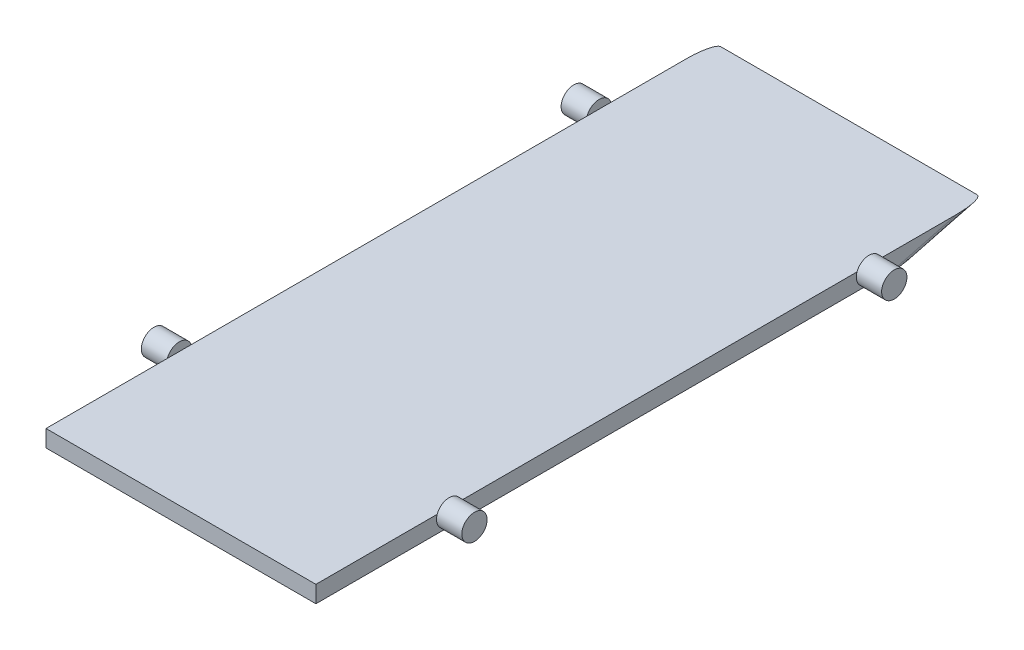
ISO-10303-21;
HEADER;
FILE_DESCRIPTION(('STEP AP214'),'2;1');
FILE_NAME('part.step','',(''),(''),'','','');
FILE_SCHEMA(('AUTOMOTIVE_DESIGN { 1 0 10303 214 1 1 1 1 }'));
ENDSEC;
DATA;
#1=APPLICATION_CONTEXT('core data for automotive mechanical design processes');
#2=APPLICATION_PROTOCOL_DEFINITION('international standard','automotive_design',2000,#1);
#3=PRODUCT_CONTEXT('',#1,'mechanical');
#4=PRODUCT('Part','Part','',(#3));
#5=PRODUCT_RELATED_PRODUCT_CATEGORY('part','',(#4));
#6=PRODUCT_DEFINITION_FORMATION('','',#4);
#7=PRODUCT_DEFINITION_CONTEXT('part definition',#1,'design');
#8=PRODUCT_DEFINITION('design','',#6,#7);
#9=PRODUCT_DEFINITION_SHAPE('','',#8);
#10=(LENGTH_UNIT() NAMED_UNIT(*) SI_UNIT(.MILLI.,.METRE.));
#11=(NAMED_UNIT(*) PLANE_ANGLE_UNIT() SI_UNIT($,.RADIAN.));
#12=(NAMED_UNIT(*) SI_UNIT($,.STERADIAN.) SOLID_ANGLE_UNIT());
#13=UNCERTAINTY_MEASURE_WITH_UNIT(LENGTH_MEASURE(1.E-05),#10,'distance_accuracy_value','');
#14=(GEOMETRIC_REPRESENTATION_CONTEXT(3) GLOBAL_UNCERTAINTY_ASSIGNED_CONTEXT((#13)) GLOBAL_UNIT_ASSIGNED_CONTEXT((#10,
#11,#12)) REPRESENTATION_CONTEXT('',''));
#15=CARTESIAN_POINT('',(0.,0.,0.));
#16=DIRECTION('',(0.,0.,1.));
#17=DIRECTION('',(1.,0.,0.));
#18=AXIS2_PLACEMENT_3D('',#15,#16,#17);
#19=CARTESIAN_POINT('',(40.,5.,-99.));
#20=DIRECTION('',(-1.,0.,0.));
#21=DIRECTION('',(0.,0.,1.));
#22=AXIS2_PLACEMENT_3D('',#19,#20,#21);
#23=PLANE('',#22);
#24=DIRECTION('',(0.,0.,-1.));
#25=VECTOR('',#24,1.);
#26=CARTESIAN_POINT('',(40.,5.,-99.));
#27=LINE('',#26,#25);
#28=CARTESIAN_POINT('',(40.,5.,55.9644660940673));
#29=VERTEX_POINT('',#28);
#30=CARTESIAN_POINT('',(40.,5.,-61.3933719084473));
#31=VERTEX_POINT('',#30);
#32=EDGE_CURVE('E203',#29,#31,#27,.T.);
#33=ORIENTED_EDGE('',*,*,#32,.F.);
#34=CARTESIAN_POINT('',(40.,3.75,59.5));
#35=DIRECTION('',(-1.,0.,0.));
#36=DIRECTION('',(0.,0.,1.));
#37=AXIS2_PLACEMENT_3D('',#34,#35,#36);
#38=CIRCLE('',#37,3.74999999999999);
#39=CARTESIAN_POINT('',(40.,0.,59.5));
#40=VERTEX_POINT('',#39);
#41=EDGE_CURVE('E183',#29,#40,#38,.T.);
#42=ORIENTED_EDGE('',*,*,#41,.T.);
#43=DIRECTION('',(0.,0.,-1.));
#44=VECTOR('',#43,1.);
#45=CARTESIAN_POINT('',(40.,0.,-99.));
#46=LINE('',#45,#44);
#47=CARTESIAN_POINT('',(40.,0.,-64.92890581438));
#48=VERTEX_POINT('',#47);
#49=EDGE_CURVE('E274',#40,#48,#46,.T.);
#50=ORIENTED_EDGE('',*,*,#49,.T.);
#51=CARTESIAN_POINT('',(40.,3.75,-64.92890581438));
#52=DIRECTION('',(-1.,0.,0.));
#53=DIRECTION('',(0.,0.,1.));
#54=AXIS2_PLACEMENT_3D('',#51,#52,#53);
#55=CIRCLE('',#54,3.75000000000001);
#56=EDGE_CURVE('E312',#48,#31,#55,.T.);
#57=ORIENTED_EDGE('',*,*,#56,.T.);
#58=EDGE_LOOP('',(#33,#42,#50,#57));
#59=FACE_BOUND('',#58,.T.);
#60=ADVANCED_FACE('F77',(#59),#23,.F.);
#61=CARTESIAN_POINT('',(40.,0.,-71.7485632957322));
#62=VERTEX_POINT('',#61);
#63=EDGE_CURVE('E267',#48,#62,#46,.T.);
#64=ORIENTED_EDGE('',*,*,#63,.T.);
#65=DIRECTION('',(0.,0.250993863675924,-0.967988677824814));
#66=VECTOR('',#65,1.);
#67=CARTESIAN_POINT('',(40.,6.93597735564963,-98.4980122726482));
#68=LINE('',#67,#66);
#69=CARTESIAN_POINT('',(40.,5.,-91.0316777043508));
#70=VERTEX_POINT('',#69);
#71=EDGE_CURVE('E241',#62,#70,#68,.T.);
#72=ORIENTED_EDGE('',*,*,#71,.T.);
#73=CARTESIAN_POINT('',(40.,5.,-68.4644397203128));
#74=VERTEX_POINT('',#73);
#75=EDGE_CURVE('E211',#74,#70,#27,.T.);
#76=ORIENTED_EDGE('',*,*,#75,.F.);
#77=EDGE_CURVE('E242',#74,#48,#55,.T.);
#78=ORIENTED_EDGE('',*,*,#77,.T.);
#79=EDGE_LOOP('',(#64,#72,#76,#78));
#80=FACE_BOUND('',#79,.T.);
#81=ADVANCED_FACE('F272',(#80),#23,.F.);
#82=CARTESIAN_POINT('',(-40.,5.,-99.));
#83=DIRECTION('',(1.,0.,0.));
#84=DIRECTION('',(0.,0.,-1.));
#85=AXIS2_PLACEMENT_3D('',#82,#83,#84);
#86=PLANE('',#85);
#87=CARTESIAN_POINT('',(-40.,3.75,-64.92890581438));
#88=DIRECTION('',(-1.,0.,0.));
#89=DIRECTION('',(0.,0.,1.));
#90=AXIS2_PLACEMENT_3D('',#87,#88,#89);
#91=CIRCLE('',#90,3.75000000000001);
#92=CARTESIAN_POINT('',(-40.,0.,-64.92890581438));
#93=VERTEX_POINT('',#92);
#94=CARTESIAN_POINT('',(-40.,5.,-61.3933719084473));
#95=VERTEX_POINT('',#94);
#96=EDGE_CURVE('E336',#93,#95,#91,.T.);
#97=ORIENTED_EDGE('',*,*,#96,.F.);
#98=DIRECTION('',(0.,0.,1.));
#99=VECTOR('',#98,1.);
#100=CARTESIAN_POINT('',(-40.,0.,-99.));
#101=LINE('',#100,#99);
#102=CARTESIAN_POINT('',(-40.,0.,59.5));
#103=VERTEX_POINT('',#102);
#104=EDGE_CURVE('E226',#93,#103,#101,.T.);
#105=ORIENTED_EDGE('',*,*,#104,.T.);
#106=CARTESIAN_POINT('',(-40.,3.75,59.5));
#107=DIRECTION('',(-1.,0.,0.));
#108=DIRECTION('',(0.,0.,1.));
#109=AXIS2_PLACEMENT_3D('',#106,#107,#108);
#110=CIRCLE('',#109,3.74999999999999);
#111=CARTESIAN_POINT('',(-40.,5.,55.9644660940673));
#112=VERTEX_POINT('',#111);
#113=EDGE_CURVE('E319',#112,#103,#110,.T.);
#114=ORIENTED_EDGE('',*,*,#113,.F.);
#115=DIRECTION('',(0.,0.,1.));
#116=VECTOR('',#115,1.);
#117=CARTESIAN_POINT('',(-40.,5.,-99.));
#118=LINE('',#117,#116);
#119=EDGE_CURVE('E289',#95,#112,#118,.T.);
#120=ORIENTED_EDGE('',*,*,#119,.F.);
#121=EDGE_LOOP('',(#97,#105,#114,#120));
#122=FACE_BOUND('',#121,.T.);
#123=ADVANCED_FACE('F362',(#122),#86,.F.);
#124=CARTESIAN_POINT('',(-40.,5.,-91.0316777043508));
#125=VERTEX_POINT('',#124);
#126=CARTESIAN_POINT('',(-40.,5.,-68.4644397203128));
#127=VERTEX_POINT('',#126);
#128=EDGE_CURVE('E282',#125,#127,#118,.T.);
#129=ORIENTED_EDGE('',*,*,#128,.F.);
#130=DIRECTION('',(0.,0.250993863675924,-0.967988677824814));
#131=VECTOR('',#130,1.);
#132=CARTESIAN_POINT('',(-40.,6.93597735564963,-98.4980122726482));
#133=LINE('',#132,#131);
#134=CARTESIAN_POINT('',(-40.,0.,-71.7485632957322));
#135=VERTEX_POINT('',#134);
#136=EDGE_CURVE('E12',#125,#135,#133,.F.);
#137=ORIENTED_EDGE('',*,*,#136,.T.);
#138=EDGE_CURVE('E220',#135,#93,#101,.T.);
#139=ORIENTED_EDGE('',*,*,#138,.T.);
#140=EDGE_CURVE('E287',#127,#93,#91,.T.);
#141=ORIENTED_EDGE('',*,*,#140,.F.);
#142=EDGE_LOOP('',(#129,#137,#139,#141));
#143=FACE_BOUND('',#142,.T.);
#144=ADVANCED_FACE('F285',(#143),#86,.F.);
#145=CARTESIAN_POINT('',(40.,0.,99.));
#146=VERTEX_POINT('',#145);
#147=EDGE_CURVE('E194',#146,#40,#46,.T.);
#148=ORIENTED_EDGE('',*,*,#147,.T.);
#149=CARTESIAN_POINT('',(40.,5.,63.0355339059327));
#150=VERTEX_POINT('',#149);
#151=EDGE_CURVE('E181',#40,#150,#38,.T.);
#152=ORIENTED_EDGE('',*,*,#151,.T.);
#153=CARTESIAN_POINT('',(40.,5.,99.));
#154=VERTEX_POINT('',#153);
#155=EDGE_CURVE('E192',#154,#150,#27,.T.);
#156=ORIENTED_EDGE('',*,*,#155,.F.);
#157=DIRECTION('',(0.,-1.,0.));
#158=VECTOR('',#157,1.);
#159=CARTESIAN_POINT('',(40.,5.,99.));
#160=LINE('',#159,#158);
#161=EDGE_CURVE('E231',#154,#146,#160,.T.);
#162=ORIENTED_EDGE('',*,*,#161,.T.);
#163=EDGE_LOOP('',(#148,#152,#156,#162));
#164=FACE_BOUND('',#163,.T.);
#165=ADVANCED_FACE('F190',(#164),#23,.F.);
#166=CARTESIAN_POINT('',(-40.,5.,63.0355339059327));
#167=VERTEX_POINT('',#166);
#168=EDGE_CURVE('E237',#103,#167,#110,.T.);
#169=ORIENTED_EDGE('',*,*,#168,.F.);
#170=CARTESIAN_POINT('',(-40.,0.,99.));
#171=VERTEX_POINT('',#170);
#172=EDGE_CURVE('E228',#103,#171,#101,.T.);
#173=ORIENTED_EDGE('',*,*,#172,.T.);
#174=DIRECTION('',(0.,-1.,0.));
#175=VECTOR('',#174,1.);
#176=CARTESIAN_POINT('',(-40.,5.,99.));
#177=LINE('',#176,#175);
#178=CARTESIAN_POINT('',(-40.,5.,99.));
#179=VERTEX_POINT('',#178);
#180=EDGE_CURVE('E234',#179,#171,#177,.T.);
#181=ORIENTED_EDGE('',*,*,#180,.F.);
#182=EDGE_CURVE('E209',#167,#179,#118,.T.);
#183=ORIENTED_EDGE('',*,*,#182,.F.);
#184=EDGE_LOOP('',(#169,#173,#181,#183));
#185=FACE_BOUND('',#184,.T.);
#186=ADVANCED_FACE('F303',(#185),#86,.F.);
#187=CARTESIAN_POINT('',(-40.,5.,99.));
#188=DIRECTION('',(0.,0.,-1.));
#189=DIRECTION('',(-1.,0.,0.));
#190=AXIS2_PLACEMENT_3D('',#187,#188,#189);
#191=PLANE('',#190);
#192=DIRECTION('',(1.,0.,0.));
#193=VECTOR('',#192,1.);
#194=CARTESIAN_POINT('',(-40.,0.,99.));
#195=LINE('',#194,#193);
#196=EDGE_CURVE('E217',#171,#146,#195,.T.);
#197=ORIENTED_EDGE('',*,*,#196,.T.);
#198=ORIENTED_EDGE('',*,*,#161,.F.);
#199=DIRECTION('',(1.,0.,0.));
#200=VECTOR('',#199,1.);
#201=CARTESIAN_POINT('',(-40.,5.,99.));
#202=LINE('',#201,#200);
#203=EDGE_CURVE('E199',#179,#154,#202,.T.);
#204=ORIENTED_EDGE('',*,*,#203,.F.);
#205=ORIENTED_EDGE('',*,*,#180,.T.);
#206=EDGE_LOOP('',(#197,#198,#204,#205));
#207=FACE_BOUND('',#206,.T.);
#208=ADVANCED_FACE('F305',(#207),#191,.F.);
#209=CARTESIAN_POINT('',(0.,5.,0.));
#210=DIRECTION('',(0.,1.,0.));
#211=DIRECTION('',(0.,0.,1.));
#212=AXIS2_PLACEMENT_3D('',#209,#210,#211);
#213=PLANE('',#212);
#214=ORIENTED_EDGE('',*,*,#75,.T.);
#215=CARTESIAN_POINT('',(38.,5.,-91.0316777043508));
#216=DIRECTION('',(0.,1.,0.));
#217=DIRECTION('',(0.,0.,-1.));
#218=AXIS2_PLACEMENT_3D('',#215,#216,#217);
#219=ELLIPSE('',#218,7.9683222956492,2.);
#220=CARTESIAN_POINT('',(38.,5.,-99.));
#221=VERTEX_POINT('',#220);
#222=EDGE_CURVE('E249',#70,#221,#219,.T.);
#223=ORIENTED_EDGE('',*,*,#222,.T.);
#224=DIRECTION('',(-1.,0.,0.));
#225=VECTOR('',#224,1.);
#226=CARTESIAN_POINT('',(-40.,5.,-99.));
#227=LINE('',#226,#225);
#228=CARTESIAN_POINT('',(-38.,5.,-99.));
#229=VERTEX_POINT('',#228);
#230=EDGE_CURVE('E202',#221,#229,#227,.T.);
#231=ORIENTED_EDGE('',*,*,#230,.T.);
#232=CARTESIAN_POINT('',(-38.,5.,-91.0316777043508));
#233=DIRECTION('',(0.,1.,0.));
#234=DIRECTION('',(0.,0.,-1.));
#235=AXIS2_PLACEMENT_3D('',#232,#233,#234);
#236=ELLIPSE('',#235,7.9683222956492,2.);
#237=EDGE_CURVE('E246',#229,#125,#236,.T.);
#238=ORIENTED_EDGE('',*,*,#237,.T.);
#239=ORIENTED_EDGE('',*,*,#128,.T.);
#240=DIRECTION('',(0.,0.,1.));
#241=VECTOR('',#240,1.);
#242=CARTESIAN_POINT('',(-40.,5.,0.));
#243=LINE('',#242,#241);
#244=EDGE_CURVE('E586',#127,#95,#243,.T.);
#245=ORIENTED_EDGE('',*,*,#244,.T.);
#246=ORIENTED_EDGE('',*,*,#119,.T.);
#247=EDGE_CURVE('E291',#112,#167,#118,.T.);
#248=ORIENTED_EDGE('',*,*,#247,.T.);
#249=ORIENTED_EDGE('',*,*,#182,.T.);
#250=ORIENTED_EDGE('',*,*,#203,.T.);
#251=ORIENTED_EDGE('',*,*,#155,.T.);
#252=DIRECTION('',(0.,0.,-1.));
#253=VECTOR('',#252,1.);
#254=CARTESIAN_POINT('',(40.,5.,0.));
#255=LINE('',#254,#253);
#256=EDGE_CURVE('E167',#150,#29,#255,.T.);
#257=ORIENTED_EDGE('',*,*,#256,.T.);
#258=ORIENTED_EDGE('',*,*,#32,.T.);
#259=EDGE_CURVE('E205',#31,#74,#27,.T.);
#260=ORIENTED_EDGE('',*,*,#259,.T.);
#261=EDGE_LOOP('',(#214,#223,#231,#238,#239,#245,#246,#248,#249,#250,#251,#257,#258,#260));
#262=FACE_BOUND('',#261,.T.);
#263=ADVANCED_FACE('F197',(#262),#213,.T.);
#264=CARTESIAN_POINT('',(0.,0.,0.));
#265=DIRECTION('',(0.,1.,0.));
#266=DIRECTION('',(0.,0.,1.));
#267=AXIS2_PLACEMENT_3D('',#264,#265,#266);
#268=PLANE('',#267);
#269=DIRECTION('',(1.,0.,0.));
#270=VECTOR('',#269,1.);
#271=CARTESIAN_POINT('',(0.,0.,-79.7168855913814));
#272=LINE('',#271,#270);
#273=CARTESIAN_POINT('',(-38.,0.,-79.7168855913814));
#274=VERTEX_POINT('',#273);
#275=CARTESIAN_POINT('',(38.,0.,-79.7168855913814));
#276=VERTEX_POINT('',#275);
#277=EDGE_CURVE('E238',#274,#276,#272,.T.);
#278=ORIENTED_EDGE('',*,*,#277,.T.);
#279=CARTESIAN_POINT('',(38.,0.,-71.7485632957322));
#280=DIRECTION('',(0.,1.,0.));
#281=DIRECTION('',(0.,0.,-1.));
#282=AXIS2_PLACEMENT_3D('',#279,#280,#281);
#283=ELLIPSE('',#282,7.9683222956492,2.);
#284=EDGE_CURVE('E86',#276,#62,#283,.F.);
#285=ORIENTED_EDGE('',*,*,#284,.T.);
#286=ORIENTED_EDGE('',*,*,#63,.F.);
#287=ORIENTED_EDGE('',*,*,#49,.F.);
#288=ORIENTED_EDGE('',*,*,#147,.F.);
#289=ORIENTED_EDGE('',*,*,#196,.F.);
#290=ORIENTED_EDGE('',*,*,#172,.F.);
#291=ORIENTED_EDGE('',*,*,#104,.F.);
#292=ORIENTED_EDGE('',*,*,#138,.F.);
#293=CARTESIAN_POINT('',(-38.,0.,-71.7485632957322));
#294=DIRECTION('',(0.,1.,0.));
#295=DIRECTION('',(0.,0.,-1.));
#296=AXIS2_PLACEMENT_3D('',#293,#294,#295);
#297=ELLIPSE('',#296,7.9683222956492,2.);
#298=EDGE_CURVE('E258',#135,#274,#297,.F.);
#299=ORIENTED_EDGE('',*,*,#298,.T.);
#300=EDGE_LOOP('',(#278,#285,#286,#287,#288,#289,#290,#291,#292,#299));
#301=FACE_BOUND('',#300,.T.);
#302=ADVANCED_FACE('F265',(#301),#268,.F.);
#303=CARTESIAN_POINT('',(-40.,0.,0.));
#304=DIRECTION('',(-1.,0.,0.));
#305=DIRECTION('',(0.,0.,1.));
#306=AXIS2_PLACEMENT_3D('',#303,#304,#305);
#307=PLANE('',#306);
#308=ORIENTED_EDGE('',*,*,#247,.F.);
#309=EDGE_CURVE('E324',#167,#112,#110,.T.);
#310=ORIENTED_EDGE('',*,*,#309,.F.);
#311=EDGE_LOOP('',(#308,#310));
#312=FACE_BOUND('',#311,.T.);
#313=ADVANCED_FACE('F379',(#312),#307,.F.);
#314=CARTESIAN_POINT('',(-47.5,3.75,59.5));
#315=DIRECTION('',(1.,0.,0.));
#316=DIRECTION('',(0.,0.,-1.));
#317=AXIS2_PLACEMENT_3D('',#314,#315,#316);
#318=CYLINDRICAL_SURFACE('',#317,3.74999999999999);
#319=CARTESIAN_POINT('',(-47.5,3.75,59.5));
#320=DIRECTION('',(-1.,0.,0.));
#321=DIRECTION('',(0.,0.,1.));
#322=AXIS2_PLACEMENT_3D('',#319,#320,#321);
#323=CIRCLE('',#322,3.74999999999999);
#324=CARTESIAN_POINT('',(-47.5,3.75,63.25));
#325=VERTEX_POINT('',#324);
#326=EDGE_CURVE('E275',#325,#325,#323,.T.);
#327=ORIENTED_EDGE('',*,*,#326,.F.);
#328=EDGE_LOOP('',(#327));
#329=FACE_BOUND('',#328,.T.);
#330=ORIENTED_EDGE('',*,*,#309,.T.);
#331=ORIENTED_EDGE('',*,*,#113,.T.);
#332=ORIENTED_EDGE('',*,*,#168,.T.);
#333=EDGE_LOOP('',(#330,#331,#332));
#334=FACE_BOUND('',#333,.T.);
#335=ADVANCED_FACE('F380',(#329,#334),#318,.T.);
#336=CARTESIAN_POINT('',(-47.5,0.,0.));
#337=DIRECTION('',(-1.,0.,0.));
#338=DIRECTION('',(0.,0.,1.));
#339=AXIS2_PLACEMENT_3D('',#336,#337,#338);
#340=PLANE('',#339);
#341=ORIENTED_EDGE('',*,*,#326,.T.);
#342=EDGE_LOOP('',(#341));
#343=FACE_BOUND('',#342,.T.);
#344=ADVANCED_FACE('F384',(#343),#340,.T.);
#345=CARTESIAN_POINT('',(-40.,0.,0.));
#346=DIRECTION('',(-1.,0.,0.));
#347=DIRECTION('',(0.,0.,1.));
#348=AXIS2_PLACEMENT_3D('',#345,#346,#347);
#349=PLANE('',#348);
#350=ORIENTED_EDGE('',*,*,#244,.F.);
#351=EDGE_CURVE('E581',#95,#127,#91,.T.);
#352=ORIENTED_EDGE('',*,*,#351,.F.);
#353=EDGE_LOOP('',(#350,#352));
#354=FACE_BOUND('',#353,.T.);
#355=ADVANCED_FACE('F391',(#354),#349,.F.);
#356=CARTESIAN_POINT('',(-47.5,3.75,-64.92890581438));
#357=DIRECTION('',(1.,0.,0.));
#358=DIRECTION('',(0.,0.,-1.));
#359=AXIS2_PLACEMENT_3D('',#356,#357,#358);
#360=CYLINDRICAL_SURFACE('',#359,3.75000000000001);
#361=ORIENTED_EDGE('',*,*,#351,.T.);
#362=ORIENTED_EDGE('',*,*,#140,.T.);
#363=ORIENTED_EDGE('',*,*,#96,.T.);
#364=EDGE_LOOP('',(#361,#362,#363));
#365=FACE_BOUND('',#364,.T.);
#366=CARTESIAN_POINT('',(-47.5,3.75,-64.92890581438));
#367=DIRECTION('',(-1.,0.,0.));
#368=DIRECTION('',(0.,0.,1.));
#369=AXIS2_PLACEMENT_3D('',#366,#367,#368);
#370=CIRCLE('',#369,3.75000000000001);
#371=CARTESIAN_POINT('',(-47.5,3.75,-61.17890581438));
#372=VERTEX_POINT('',#371);
#373=EDGE_CURVE('E332',#372,#372,#370,.T.);
#374=ORIENTED_EDGE('',*,*,#373,.F.);
#375=EDGE_LOOP('',(#374));
#376=FACE_BOUND('',#375,.T.);
#377=ADVANCED_FACE('F393',(#365,#376),#360,.T.);
#378=CARTESIAN_POINT('',(-47.5,0.,0.));
#379=DIRECTION('',(-1.,0.,0.));
#380=DIRECTION('',(0.,0.,1.));
#381=AXIS2_PLACEMENT_3D('',#378,#379,#380);
#382=PLANE('',#381);
#383=ORIENTED_EDGE('',*,*,#373,.T.);
#384=EDGE_LOOP('',(#383));
#385=FACE_BOUND('',#384,.T.);
#386=ADVANCED_FACE('F394',(#385),#382,.T.);
#387=CARTESIAN_POINT('',(47.5,3.75,-64.92890581438));
#388=DIRECTION('',(-1.,0.,0.));
#389=DIRECTION('',(0.,0.,1.));
#390=AXIS2_PLACEMENT_3D('',#387,#388,#389);
#391=CYLINDRICAL_SURFACE('',#390,3.75000000000001);
#392=EDGE_CURVE('E175',#31,#74,#55,.T.);
#393=ORIENTED_EDGE('',*,*,#392,.F.);
#394=ORIENTED_EDGE('',*,*,#56,.F.);
#395=ORIENTED_EDGE('',*,*,#77,.F.);
#396=EDGE_LOOP('',(#393,#394,#395));
#397=FACE_BOUND('',#396,.T.);
#398=CARTESIAN_POINT('',(47.5,3.75,-64.92890581438));
#399=DIRECTION('',(-1.,0.,0.));
#400=DIRECTION('',(0.,0.,1.));
#401=AXIS2_PLACEMENT_3D('',#398,#399,#400);
#402=CIRCLE('',#401,3.75000000000001);
#403=CARTESIAN_POINT('',(47.5,3.75,-61.17890581438));
#404=VERTEX_POINT('',#403);
#405=EDGE_CURVE('E328',#404,#404,#402,.T.);
#406=ORIENTED_EDGE('',*,*,#405,.T.);
#407=EDGE_LOOP('',(#406));
#408=FACE_BOUND('',#407,.T.);
#409=ADVANCED_FACE('F315',(#397,#408),#391,.T.);
#410=CARTESIAN_POINT('',(47.5,0.,0.));
#411=DIRECTION('',(1.,0.,0.));
#412=DIRECTION('',(0.,0.,1.));
#413=AXIS2_PLACEMENT_3D('',#410,#411,#412);
#414=PLANE('',#413);
#415=ORIENTED_EDGE('',*,*,#405,.F.);
#416=EDGE_LOOP('',(#415));
#417=FACE_BOUND('',#416,.T.);
#418=ADVANCED_FACE('F404',(#417),#414,.T.);
#419=CARTESIAN_POINT('',(40.,0.,0.));
#420=DIRECTION('',(1.,0.,0.));
#421=DIRECTION('',(0.,0.,1.));
#422=AXIS2_PLACEMENT_3D('',#419,#420,#421);
#423=PLANE('',#422);
#424=ORIENTED_EDGE('',*,*,#259,.F.);
#425=ORIENTED_EDGE('',*,*,#392,.T.);
#426=EDGE_LOOP('',(#424,#425));
#427=FACE_BOUND('',#426,.T.);
#428=ADVANCED_FACE('F352',(#427),#423,.F.);
#429=CARTESIAN_POINT('',(47.5,3.75,59.5));
#430=DIRECTION('',(-1.,0.,0.));
#431=DIRECTION('',(0.,0.,1.));
#432=AXIS2_PLACEMENT_3D('',#429,#430,#431);
#433=CYLINDRICAL_SURFACE('',#432,3.74999999999999);
#434=CARTESIAN_POINT('',(47.5,3.75,59.5));
#435=DIRECTION('',(-1.,0.,0.));
#436=DIRECTION('',(0.,0.,1.));
#437=AXIS2_PLACEMENT_3D('',#434,#435,#436);
#438=CIRCLE('',#437,3.74999999999999);
#439=CARTESIAN_POINT('',(47.5,3.75,63.25));
#440=VERTEX_POINT('',#439);
#441=EDGE_CURVE('E176',#440,#440,#438,.T.);
#442=ORIENTED_EDGE('',*,*,#441,.T.);
#443=EDGE_LOOP('',(#442));
#444=FACE_BOUND('',#443,.T.);
#445=EDGE_CURVE('E170',#150,#29,#38,.T.);
#446=ORIENTED_EDGE('',*,*,#445,.F.);
#447=ORIENTED_EDGE('',*,*,#151,.F.);
#448=ORIENTED_EDGE('',*,*,#41,.F.);
#449=EDGE_LOOP('',(#446,#447,#448));
#450=FACE_BOUND('',#449,.T.);
#451=ADVANCED_FACE('F180',(#444,#450),#433,.T.);
#452=CARTESIAN_POINT('',(47.5,0.,0.));
#453=DIRECTION('',(1.,0.,0.));
#454=DIRECTION('',(0.,0.,1.));
#455=AXIS2_PLACEMENT_3D('',#452,#453,#454);
#456=PLANE('',#455);
#457=ORIENTED_EDGE('',*,*,#441,.F.);
#458=EDGE_LOOP('',(#457));
#459=FACE_BOUND('',#458,.T.);
#460=ADVANCED_FACE('F344',(#459),#456,.T.);
#461=CARTESIAN_POINT('',(40.,0.,0.));
#462=DIRECTION('',(1.,0.,0.));
#463=DIRECTION('',(0.,0.,1.));
#464=AXIS2_PLACEMENT_3D('',#461,#462,#463);
#465=PLANE('',#464);
#466=ORIENTED_EDGE('',*,*,#256,.F.);
#467=ORIENTED_EDGE('',*,*,#445,.T.);
#468=EDGE_LOOP('',(#466,#467));
#469=FACE_BOUND('',#468,.T.);
#470=ADVANCED_FACE('F169',(#469),#465,.F.);
#471=CARTESIAN_POINT('',(47.5,5.,-99.));
#472=DIRECTION('',(0.,0.967988677824814,0.250993863675924));
#473=DIRECTION('',(0.,-0.250993863675924,0.967988677824814));
#474=AXIS2_PLACEMENT_3D('',#471,#472,#473);
#475=PLANE('',#474);
#476=ORIENTED_EDGE('',*,*,#230,.F.);
#477=DIRECTION('',(0.,0.250993863675924,-0.967988677824814));
#478=VECTOR('',#477,1.);
#479=CARTESIAN_POINT('',(38.,5.,-99.));
#480=LINE('',#479,#478);
#481=EDGE_CURVE('E99',#221,#276,#480,.F.);
#482=ORIENTED_EDGE('',*,*,#481,.T.);
#483=ORIENTED_EDGE('',*,*,#277,.F.);
#484=DIRECTION('',(0.,0.250993863675924,-0.967988677824814));
#485=VECTOR('',#484,1.);
#486=CARTESIAN_POINT('',(-38.,5.,-99.));
#487=LINE('',#486,#485);
#488=EDGE_CURVE('E252',#274,#229,#487,.T.);
#489=ORIENTED_EDGE('',*,*,#488,.T.);
#490=EDGE_LOOP('',(#476,#482,#483,#489));
#491=FACE_BOUND('',#490,.T.);
#492=ADVANCED_FACE('F277',(#491),#475,.F.);
#493=CARTESIAN_POINT('',(38.,6.93597735564963,-98.4980122726482));
#494=DIRECTION('',(0.,0.250993863675924,-0.967988677824814));
#495=DIRECTION('',(0.,0.967988677824814,0.250993863675924));
#496=AXIS2_PLACEMENT_3D('',#493,#494,#495);
#497=CYLINDRICAL_SURFACE('',#496,2.);
#498=ORIENTED_EDGE('',*,*,#284,.F.);
#499=ORIENTED_EDGE('',*,*,#481,.F.);
#500=ORIENTED_EDGE('',*,*,#222,.F.);
#501=ORIENTED_EDGE('',*,*,#71,.F.);
#502=EDGE_LOOP('',(#498,#499,#500,#501));
#503=FACE_BOUND('',#502,.T.);
#504=ADVANCED_FACE('F276',(#503),#497,.T.);
#505=CARTESIAN_POINT('',(-38.,6.93597735564963,-98.4980122726482));
#506=DIRECTION('',(0.,0.250993863675924,-0.967988677824814));
#507=DIRECTION('',(0.,0.967988677824814,0.250993863675924));
#508=AXIS2_PLACEMENT_3D('',#505,#506,#507);
#509=CYLINDRICAL_SURFACE('',#508,2.);
#510=ORIENTED_EDGE('',*,*,#298,.F.);
#511=ORIENTED_EDGE('',*,*,#136,.F.);
#512=ORIENTED_EDGE('',*,*,#237,.F.);
#513=ORIENTED_EDGE('',*,*,#488,.F.);
#514=EDGE_LOOP('',(#510,#511,#512,#513));
#515=FACE_BOUND('',#514,.T.);
#516=ADVANCED_FACE('F79',(#515),#509,.T.);
#517=CLOSED_SHELL('',(#60,#81,#123,#144,#165,#186,#208,#263,#302,#313,#335,#344,#355,#377,#386,
#409,#418,#428,#451,#460,#470,#492,#504,#516));
#518=MANIFOLD_SOLID_BREP('B2',#517);
#519=ADVANCED_BREP_SHAPE_REPRESENTATION('',(#18,#518),#14);
#520=SHAPE_DEFINITION_REPRESENTATION(#9,#519);
ENDSEC;
END-ISO-10303-21;
